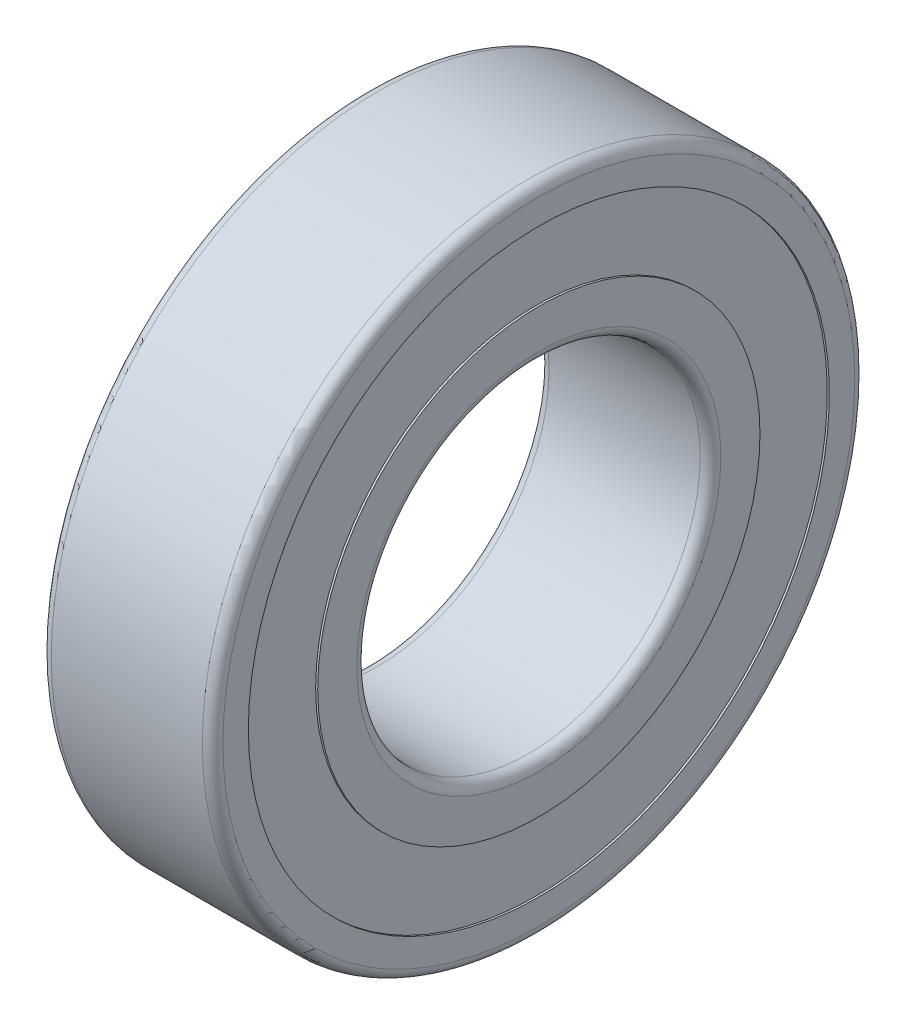
ISO-10303-21;
HEADER;
FILE_DESCRIPTION(('STEP AP214'),'2;1');
FILE_NAME('part.step','',(''),(''),'','','');
FILE_SCHEMA(('AUTOMOTIVE_DESIGN { 1 0 10303 214 1 1 1 1 }'));
ENDSEC;
DATA;
#1=APPLICATION_CONTEXT('core data for automotive mechanical design processes');
#2=APPLICATION_PROTOCOL_DEFINITION('international standard','automotive_design',2000,#1);
#3=PRODUCT_CONTEXT('',#1,'mechanical');
#4=PRODUCT('Part','Part','',(#3));
#5=PRODUCT_RELATED_PRODUCT_CATEGORY('part','',(#4));
#6=PRODUCT_DEFINITION_FORMATION('','',#4);
#7=PRODUCT_DEFINITION_CONTEXT('part definition',#1,'design');
#8=PRODUCT_DEFINITION('design','',#6,#7);
#9=PRODUCT_DEFINITION_SHAPE('','',#8);
#10=(LENGTH_UNIT() NAMED_UNIT(*) SI_UNIT(.MILLI.,.METRE.));
#11=(NAMED_UNIT(*) PLANE_ANGLE_UNIT() SI_UNIT($,.RADIAN.));
#12=(NAMED_UNIT(*) SI_UNIT($,.STERADIAN.) SOLID_ANGLE_UNIT());
#13=UNCERTAINTY_MEASURE_WITH_UNIT(LENGTH_MEASURE(1.E-05),#10,'distance_accuracy_value','');
#14=(GEOMETRIC_REPRESENTATION_CONTEXT(3) GLOBAL_UNCERTAINTY_ASSIGNED_CONTEXT((#13)) GLOBAL_UNIT_ASSIGNED_CONTEXT((#10,
#11,#12)) REPRESENTATION_CONTEXT('',''));
#15=CARTESIAN_POINT('',(0.,0.,0.));
#16=DIRECTION('',(0.,0.,1.));
#17=DIRECTION('',(1.,0.,0.));
#18=AXIS2_PLACEMENT_3D('',#15,#16,#17);
#19=CARTESIAN_POINT('',(2.5,7.25,0.));
#20=DIRECTION('',(0.,-1.,0.));
#21=DIRECTION('',(0.,0.,1.));
#22=AXIS2_PLACEMENT_3D('',#19,#20,#21);
#23=SPHERICAL_SURFACE('',#22,1.3275);
#24=CARTESIAN_POINT('',(2.5,8.5775,0.));
#25=VERTEX_POINT('',#24);
#26=VERTEX_LOOP('',#25);
#27=FACE_BOUND('',#26,.T.);
#28=CARTESIAN_POINT('',(2.5,5.9225,0.));
#29=VERTEX_POINT('',#28);
#30=VERTEX_LOOP('',#29);
#31=FACE_BOUND('',#30,.T.);
#32=ADVANCED_FACE('P0_F16',(#27,#31),#23,.T.);
#33=CLOSED_SHELL('',(#32));
#34=MANIFOLD_SOLID_BREP('P0_B1',#33);
#35=CARTESIAN_POINT('',(2.5,5.86537320921837,-4.26144307912043));
#36=DIRECTION('',(0.,-1.,0.));
#37=DIRECTION('',(0.,0.,1.));
#38=AXIS2_PLACEMENT_3D('',#35,#36,#37);
#39=SPHERICAL_SURFACE('',#38,1.3275);
#40=CARTESIAN_POINT('',(2.5,7.19287320921837,-4.26144307912043));
#41=VERTEX_POINT('',#40);
#42=VERTEX_LOOP('',#41);
#43=FACE_BOUND('',#42,.T.);
#44=CARTESIAN_POINT('',(2.5,4.53787320921837,-4.26144307912043));
#45=VERTEX_POINT('',#44);
#46=VERTEX_LOOP('',#45);
#47=FACE_BOUND('',#46,.T.);
#48=ADVANCED_FACE('P1_F16',(#43,#47),#39,.T.);
#49=CLOSED_SHELL('',(#48));
#50=MANIFOLD_SOLID_BREP('P1_B1',#49);
#51=CARTESIAN_POINT('',(2.5,5.86537320921837,4.26144307912043));
#52=DIRECTION('',(0.,-1.,0.));
#53=DIRECTION('',(0.,0.,1.));
#54=AXIS2_PLACEMENT_3D('',#51,#52,#53);
#55=SPHERICAL_SURFACE('',#54,1.3275);
#56=CARTESIAN_POINT('',(2.5,7.19287320921837,4.26144307912043));
#57=VERTEX_POINT('',#56);
#58=VERTEX_LOOP('',#57);
#59=FACE_BOUND('',#58,.T.);
#60=CARTESIAN_POINT('',(2.5,4.53787320921837,4.26144307912043));
#61=VERTEX_POINT('',#60);
#62=VERTEX_LOOP('',#61);
#63=FACE_BOUND('',#62,.T.);
#64=ADVANCED_FACE('P2_F16',(#59,#63),#55,.T.);
#65=CLOSED_SHELL('',(#64));
#66=MANIFOLD_SOLID_BREP('P2_B1',#65);
#67=CARTESIAN_POINT('',(2.5,2.24037320921837,6.89515974313986));
#68=DIRECTION('',(0.,-1.,0.));
#69=DIRECTION('',(0.,0.,1.));
#70=AXIS2_PLACEMENT_3D('',#67,#68,#69);
#71=SPHERICAL_SURFACE('',#70,1.3275);
#72=CARTESIAN_POINT('',(2.5,3.56787320921837,6.89515974313986));
#73=VERTEX_POINT('',#72);
#74=VERTEX_LOOP('',#73);
#75=FACE_BOUND('',#74,.T.);
#76=CARTESIAN_POINT('',(2.5,0.91287320921837,6.89515974313986));
#77=VERTEX_POINT('',#76);
#78=VERTEX_LOOP('',#77);
#79=FACE_BOUND('',#78,.T.);
#80=ADVANCED_FACE('P3_F16',(#75,#79),#71,.T.);
#81=CLOSED_SHELL('',(#80));
#82=MANIFOLD_SOLID_BREP('P3_B1',#81);
#83=CARTESIAN_POINT('',(2.5,-2.24037320921837,6.89515974313986));
#84=DIRECTION('',(0.,-1.,0.));
#85=DIRECTION('',(0.,0.,1.));
#86=AXIS2_PLACEMENT_3D('',#83,#84,#85);
#87=SPHERICAL_SURFACE('',#86,1.3275);
#88=CARTESIAN_POINT('',(2.5,-0.91287320921837,6.89515974313986));
#89=VERTEX_POINT('',#88);
#90=VERTEX_LOOP('',#89);
#91=FACE_BOUND('',#90,.T.);
#92=CARTESIAN_POINT('',(2.5,-3.56787320921837,6.89515974313986));
#93=VERTEX_POINT('',#92);
#94=VERTEX_LOOP('',#93);
#95=FACE_BOUND('',#94,.T.);
#96=ADVANCED_FACE('P4_F16',(#91,#95),#87,.T.);
#97=CLOSED_SHELL('',(#96));
#98=MANIFOLD_SOLID_BREP('P4_B1',#97);
#99=CARTESIAN_POINT('',(2.5,-5.86537320921837,4.26144307912043));
#100=DIRECTION('',(0.,-1.,0.));
#101=DIRECTION('',(0.,0.,1.));
#102=AXIS2_PLACEMENT_3D('',#99,#100,#101);
#103=SPHERICAL_SURFACE('',#102,1.3275);
#104=CARTESIAN_POINT('',(2.5,-4.53787320921837,4.26144307912043));
#105=VERTEX_POINT('',#104);
#106=VERTEX_LOOP('',#105);
#107=FACE_BOUND('',#106,.T.);
#108=CARTESIAN_POINT('',(2.5,-7.19287320921837,4.26144307912043));
#109=VERTEX_POINT('',#108);
#110=VERTEX_LOOP('',#109);
#111=FACE_BOUND('',#110,.T.);
#112=ADVANCED_FACE('P5_F16',(#107,#111),#103,.T.);
#113=CLOSED_SHELL('',(#112));
#114=MANIFOLD_SOLID_BREP('P5_B1',#113);
#115=CARTESIAN_POINT('',(2.5,-7.25,0.));
#116=DIRECTION('',(0.,-1.,0.));
#117=DIRECTION('',(0.,0.,1.));
#118=AXIS2_PLACEMENT_3D('',#115,#116,#117);
#119=SPHERICAL_SURFACE('',#118,1.3275);
#120=CARTESIAN_POINT('',(2.5,-5.9225,0.));
#121=VERTEX_POINT('',#120);
#122=VERTEX_LOOP('',#121);
#123=FACE_BOUND('',#122,.T.);
#124=CARTESIAN_POINT('',(2.5,-8.5775,0.));
#125=VERTEX_POINT('',#124);
#126=VERTEX_LOOP('',#125);
#127=FACE_BOUND('',#126,.T.);
#128=ADVANCED_FACE('P6_F16',(#123,#127),#119,.T.);
#129=CLOSED_SHELL('',(#128));
#130=MANIFOLD_SOLID_BREP('P6_B1',#129);
#131=CARTESIAN_POINT('',(2.5,-5.86537320921837,-4.26144307912043));
#132=DIRECTION('',(0.,-1.,0.));
#133=DIRECTION('',(0.,0.,1.));
#134=AXIS2_PLACEMENT_3D('',#131,#132,#133);
#135=SPHERICAL_SURFACE('',#134,1.3275);
#136=CARTESIAN_POINT('',(2.5,-4.53787320921837,-4.26144307912043));
#137=VERTEX_POINT('',#136);
#138=VERTEX_LOOP('',#137);
#139=FACE_BOUND('',#138,.T.);
#140=CARTESIAN_POINT('',(2.5,-7.19287320921837,-4.26144307912043));
#141=VERTEX_POINT('',#140);
#142=VERTEX_LOOP('',#141);
#143=FACE_BOUND('',#142,.T.);
#144=ADVANCED_FACE('P7_F16',(#139,#143),#135,.T.);
#145=CLOSED_SHELL('',(#144));
#146=MANIFOLD_SOLID_BREP('P7_B1',#145);
#147=CARTESIAN_POINT('',(2.5,-2.24037320921837,-6.89515974313986));
#148=DIRECTION('',(0.,-1.,0.));
#149=DIRECTION('',(0.,0.,1.));
#150=AXIS2_PLACEMENT_3D('',#147,#148,#149);
#151=SPHERICAL_SURFACE('',#150,1.3275);
#152=CARTESIAN_POINT('',(2.5,-0.91287320921837,-6.89515974313986));
#153=VERTEX_POINT('',#152);
#154=VERTEX_LOOP('',#153);
#155=FACE_BOUND('',#154,.T.);
#156=CARTESIAN_POINT('',(2.5,-3.56787320921837,-6.89515974313986));
#157=VERTEX_POINT('',#156);
#158=VERTEX_LOOP('',#157);
#159=FACE_BOUND('',#158,.T.);
#160=ADVANCED_FACE('P8_F16',(#155,#159),#151,.T.);
#161=CLOSED_SHELL('',(#160));
#162=MANIFOLD_SOLID_BREP('P8_B1',#161);
#163=CARTESIAN_POINT('',(2.5,2.24037320921837,-6.89515974313986));
#164=DIRECTION('',(0.,-1.,0.));
#165=DIRECTION('',(0.,0.,1.));
#166=AXIS2_PLACEMENT_3D('',#163,#164,#165);
#167=SPHERICAL_SURFACE('',#166,1.3275);
#168=CARTESIAN_POINT('',(2.5,3.56787320921837,-6.89515974313986));
#169=VERTEX_POINT('',#168);
#170=VERTEX_LOOP('',#169);
#171=FACE_BOUND('',#170,.T.);
#172=CARTESIAN_POINT('',(2.5,0.91287320921837,-6.89515974313986));
#173=VERTEX_POINT('',#172);
#174=VERTEX_LOOP('',#173);
#175=FACE_BOUND('',#174,.T.);
#176=ADVANCED_FACE('P9_F16',(#171,#175),#167,.T.);
#177=CLOSED_SHELL('',(#176));
#178=MANIFOLD_SOLID_BREP('P9_B1',#177);
#179=CARTESIAN_POINT('',(2.5,0.,0.));
#180=DIRECTION('',(1.,0.,0.));
#181=DIRECTION('',(0.,0.,-1.));
#182=AXIS2_PLACEMENT_3D('',#179,#180,#181);
#183=TOROIDAL_SURFACE('',#182,7.25,1.35);
#184=CARTESIAN_POINT('',(1.42,0.,0.));
#185=DIRECTION('',(-1.,0.,0.));
#186=DIRECTION('',(0.,0.,1.));
#187=AXIS2_PLACEMENT_3D('',#184,#185,#186);
#188=CIRCLE('',#187,6.44);
#189=CARTESIAN_POINT('',(1.42,0.,6.44));
#190=VERTEX_POINT('',#189);
#191=EDGE_CURVE('P10_E110',#190,#190,#188,.T.);
#192=ORIENTED_EDGE('',*,*,#191,.F.);
#193=EDGE_LOOP('',(#192));
#194=FACE_BOUND('',#193,.T.);
#195=CARTESIAN_POINT('',(3.58,0.,0.));
#196=DIRECTION('',(-1.,0.,0.));
#197=DIRECTION('',(0.,0.,1.));
#198=AXIS2_PLACEMENT_3D('',#195,#196,#197);
#199=CIRCLE('',#198,6.44);
#200=CARTESIAN_POINT('',(3.58,0.,6.44));
#201=VERTEX_POINT('',#200);
#202=EDGE_CURVE('P10_E115',#201,#201,#199,.F.);
#203=ORIENTED_EDGE('',*,*,#202,.F.);
#204=EDGE_LOOP('',(#203));
#205=FACE_BOUND('',#204,.T.);
#206=ADVANCED_FACE('P10_F15',(#194,#205),#183,.F.);
#207=CARTESIAN_POINT('',(5.,0.,0.));
#208=DIRECTION('',(-1.,0.,0.));
#209=DIRECTION('',(0.,0.,1.));
#210=AXIS2_PLACEMENT_3D('',#207,#208,#209);
#211=CYLINDRICAL_SURFACE('',#210,6.44);
#212=CARTESIAN_POINT('',(5.,0.,0.));
#213=DIRECTION('',(-1.,0.,0.));
#214=DIRECTION('',(0.,0.,1.));
#215=AXIS2_PLACEMENT_3D('',#212,#213,#214);
#216=CIRCLE('',#215,6.44);
#217=CARTESIAN_POINT('',(5.,0.,6.44));
#218=VERTEX_POINT('',#217);
#219=EDGE_CURVE('P10_E19',#218,#218,#216,.F.);
#220=ORIENTED_EDGE('',*,*,#219,.F.);
#221=EDGE_LOOP('',(#220));
#222=FACE_BOUND('',#221,.T.);
#223=ORIENTED_EDGE('',*,*,#202,.T.);
#224=EDGE_LOOP('',(#223));
#225=FACE_BOUND('',#224,.T.);
#226=ADVANCED_FACE('P10_F85',(#222,#225),#211,.T.);
#227=CARTESIAN_POINT('',(5.,0.,0.));
#228=DIRECTION('',(-1.,0.,0.));
#229=DIRECTION('',(0.,0.,1.));
#230=AXIS2_PLACEMENT_3D('',#227,#228,#229);
#231=CYLINDRICAL_SURFACE('',#230,6.44);
#232=ORIENTED_EDGE('',*,*,#191,.T.);
#233=EDGE_LOOP('',(#232));
#234=FACE_BOUND('',#233,.T.);
#235=CARTESIAN_POINT('',(0.,0.,0.));
#236=DIRECTION('',(-1.,0.,0.));
#237=DIRECTION('',(0.,0.,1.));
#238=AXIS2_PLACEMENT_3D('',#235,#236,#237);
#239=CIRCLE('',#238,6.44);
#240=CARTESIAN_POINT('',(0.,0.,6.44));
#241=VERTEX_POINT('',#240);
#242=EDGE_CURVE('P10_E105',#241,#241,#239,.T.);
#243=ORIENTED_EDGE('',*,*,#242,.F.);
#244=EDGE_LOOP('',(#243));
#245=FACE_BOUND('',#244,.T.);
#246=ADVANCED_FACE('P10_F82',(#234,#245),#231,.T.);
#247=CARTESIAN_POINT('',(5.,5.3,0.));
#248=DIRECTION('',(1.,0.,0.));
#249=DIRECTION('',(0.,0.,-1.));
#250=AXIS2_PLACEMENT_3D('',#247,#248,#249);
#251=PLANE('',#250);
#252=CARTESIAN_POINT('',(5.,0.,0.));
#253=DIRECTION('',(1.,0.,0.));
#254=DIRECTION('',(0.,0.,-1.));
#255=AXIS2_PLACEMENT_3D('',#252,#253,#254);
#256=CIRCLE('',#255,5.3);
#257=CARTESIAN_POINT('',(5.,0.,-5.3));
#258=VERTEX_POINT('',#257);
#259=EDGE_CURVE('P10_E66',#258,#258,#256,.T.);
#260=ORIENTED_EDGE('',*,*,#259,.F.);
#261=EDGE_LOOP('',(#260));
#262=FACE_BOUND('',#261,.T.);
#263=ORIENTED_EDGE('',*,*,#219,.T.);
#264=EDGE_LOOP('',(#263));
#265=FACE_BOUND('',#264,.T.);
#266=ADVANCED_FACE('P10_F72',(#262,#265),#251,.T.);
#267=CARTESIAN_POINT('',(0.,6.44,0.));
#268=DIRECTION('',(-1.,0.,0.));
#269=DIRECTION('',(0.,0.,1.));
#270=AXIS2_PLACEMENT_3D('',#267,#268,#269);
#271=PLANE('',#270);
#272=ORIENTED_EDGE('',*,*,#242,.T.);
#273=EDGE_LOOP('',(#272));
#274=FACE_BOUND('',#273,.T.);
#275=CARTESIAN_POINT('',(0.,0.,0.));
#276=DIRECTION('',(-1.,0.,0.));
#277=DIRECTION('',(0.,0.,-1.));
#278=AXIS2_PLACEMENT_3D('',#275,#276,#277);
#279=CIRCLE('',#278,5.3);
#280=CARTESIAN_POINT('',(0.,0.,-5.3));
#281=VERTEX_POINT('',#280);
#282=EDGE_CURVE('P10_E28',#281,#281,#279,.T.);
#283=ORIENTED_EDGE('',*,*,#282,.F.);
#284=EDGE_LOOP('',(#283));
#285=FACE_BOUND('',#284,.T.);
#286=ADVANCED_FACE('P10_F81',(#274,#285),#271,.T.);
#287=CARTESIAN_POINT('',(4.7,0.,0.));
#288=DIRECTION('',(1.,0.,0.));
#289=DIRECTION('',(0.,0.,-1.));
#290=AXIS2_PLACEMENT_3D('',#287,#288,#289);
#291=TOROIDAL_SURFACE('',#290,5.3,0.300000000000003);
#292=CARTESIAN_POINT('',(4.7,0.,0.));
#293=DIRECTION('',(-1.,0.,0.));
#294=DIRECTION('',(0.,0.,1.));
#295=AXIS2_PLACEMENT_3D('',#292,#293,#294);
#296=CIRCLE('',#295,5.);
#297=CARTESIAN_POINT('',(4.7,0.,5.));
#298=VERTEX_POINT('',#297);
#299=EDGE_CURVE('P10_E23',#298,#298,#296,.T.);
#300=ORIENTED_EDGE('',*,*,#299,.T.);
#301=EDGE_LOOP('',(#300));
#302=FACE_BOUND('',#301,.T.);
#303=ORIENTED_EDGE('',*,*,#259,.T.);
#304=EDGE_LOOP('',(#303));
#305=FACE_BOUND('',#304,.T.);
#306=ADVANCED_FACE('P10_F46',(#302,#305),#291,.T.);
#307=CARTESIAN_POINT('',(0.300000000000002,0.,0.));
#308=DIRECTION('',(1.,0.,0.));
#309=DIRECTION('',(0.,0.,-1.));
#310=AXIS2_PLACEMENT_3D('',#307,#308,#309);
#311=TOROIDAL_SURFACE('',#310,5.3,0.300000000000002);
#312=ORIENTED_EDGE('',*,*,#282,.T.);
#313=EDGE_LOOP('',(#312));
#314=FACE_BOUND('',#313,.T.);
#315=CARTESIAN_POINT('',(0.300000000000002,0.,0.));
#316=DIRECTION('',(-1.,0.,0.));
#317=DIRECTION('',(0.,0.,1.));
#318=AXIS2_PLACEMENT_3D('',#315,#316,#317);
#319=CIRCLE('',#318,5.);
#320=CARTESIAN_POINT('',(0.300000000000002,0.,5.));
#321=VERTEX_POINT('',#320);
#322=EDGE_CURVE('P10_E10',#321,#321,#319,.F.);
#323=ORIENTED_EDGE('',*,*,#322,.T.);
#324=EDGE_LOOP('',(#323));
#325=FACE_BOUND('',#324,.T.);
#326=ADVANCED_FACE('P10_F40',(#314,#325),#311,.T.);
#327=CARTESIAN_POINT('',(5.,0.,0.));
#328=DIRECTION('',(-1.,0.,0.));
#329=DIRECTION('',(0.,0.,1.));
#330=AXIS2_PLACEMENT_3D('',#327,#328,#329);
#331=CYLINDRICAL_SURFACE('',#330,5.);
#332=ORIENTED_EDGE('',*,*,#322,.F.);
#333=EDGE_LOOP('',(#332));
#334=FACE_BOUND('',#333,.T.);
#335=ORIENTED_EDGE('',*,*,#299,.F.);
#336=EDGE_LOOP('',(#335));
#337=FACE_BOUND('',#336,.T.);
#338=ADVANCED_FACE('P10_F45',(#334,#337),#331,.F.);
#339=CLOSED_SHELL('',(#206,#226,#246,#266,#286,#306,#326,#338));
#340=MANIFOLD_SOLID_BREP('P10_B1',#339);
#341=CARTESIAN_POINT('',(2.5,0.,0.));
#342=DIRECTION('',(1.,0.,0.));
#343=DIRECTION('',(0.,0.,-1.));
#344=AXIS2_PLACEMENT_3D('',#341,#342,#343);
#345=TOROIDAL_SURFACE('',#344,7.25,1.35);
#346=CARTESIAN_POINT('',(3.58,0.,0.));
#347=DIRECTION('',(-1.,0.,0.));
#348=DIRECTION('',(0.,0.,1.));
#349=AXIS2_PLACEMENT_3D('',#346,#347,#348);
#350=CIRCLE('',#349,8.06);
#351=CARTESIAN_POINT('',(3.58,0.,8.06));
#352=VERTEX_POINT('',#351);
#353=EDGE_CURVE('P11_E140',#352,#352,#350,.F.);
#354=ORIENTED_EDGE('',*,*,#353,.T.);
#355=EDGE_LOOP('',(#354));
#356=FACE_BOUND('',#355,.T.);
#357=CARTESIAN_POINT('',(1.42,0.,0.));
#358=DIRECTION('',(-1.,0.,0.));
#359=DIRECTION('',(0.,0.,1.));
#360=AXIS2_PLACEMENT_3D('',#357,#358,#359);
#361=CIRCLE('',#360,8.06);
#362=CARTESIAN_POINT('',(1.42,0.,8.06));
#363=VERTEX_POINT('',#362);
#364=EDGE_CURVE('P11_E143',#363,#363,#361,.T.);
#365=ORIENTED_EDGE('',*,*,#364,.T.);
#366=EDGE_LOOP('',(#365));
#367=FACE_BOUND('',#366,.T.);
#368=ADVANCED_FACE('P11_F15',(#356,#367),#345,.F.);
#369=CARTESIAN_POINT('',(5.,0.,0.));
#370=DIRECTION('',(-1.,0.,0.));
#371=DIRECTION('',(0.,0.,1.));
#372=AXIS2_PLACEMENT_3D('',#369,#370,#371);
#373=CYLINDRICAL_SURFACE('',#372,8.06);
#374=CARTESIAN_POINT('',(0.23,0.,0.));
#375=DIRECTION('',(-1.,0.,0.));
#376=DIRECTION('',(0.,0.,1.));
#377=AXIS2_PLACEMENT_3D('',#374,#375,#376);
#378=CIRCLE('',#377,8.06);
#379=CARTESIAN_POINT('',(0.23,0.,8.06));
#380=VERTEX_POINT('',#379);
#381=EDGE_CURVE('P11_E19',#380,#380,#378,.T.);
#382=ORIENTED_EDGE('',*,*,#381,.T.);
#383=EDGE_LOOP('',(#382));
#384=FACE_BOUND('',#383,.T.);
#385=ORIENTED_EDGE('',*,*,#364,.F.);
#386=EDGE_LOOP('',(#385));
#387=FACE_BOUND('',#386,.T.);
#388=ADVANCED_FACE('P11_F101',(#384,#387),#373,.F.);
#389=CARTESIAN_POINT('',(5.,0.,0.));
#390=DIRECTION('',(-1.,0.,0.));
#391=DIRECTION('',(0.,0.,1.));
#392=AXIS2_PLACEMENT_3D('',#389,#390,#391);
#393=CYLINDRICAL_SURFACE('',#392,8.06);
#394=ORIENTED_EDGE('',*,*,#353,.F.);
#395=EDGE_LOOP('',(#394));
#396=FACE_BOUND('',#395,.T.);
#397=CARTESIAN_POINT('',(4.77,0.,0.));
#398=DIRECTION('',(-1.,0.,0.));
#399=DIRECTION('',(0.,0.,1.));
#400=AXIS2_PLACEMENT_3D('',#397,#398,#399);
#401=CIRCLE('',#400,8.06);
#402=CARTESIAN_POINT('',(4.77,0.,8.06));
#403=VERTEX_POINT('',#402);
#404=EDGE_CURVE('P11_E136',#403,#403,#401,.F.);
#405=ORIENTED_EDGE('',*,*,#404,.T.);
#406=EDGE_LOOP('',(#405));
#407=FACE_BOUND('',#406,.T.);
#408=ADVANCED_FACE('P11_F98',(#396,#407),#393,.F.);
#409=CARTESIAN_POINT('',(0.23,7.925,0.));
#410=DIRECTION('',(1.,0.,0.));
#411=DIRECTION('',(0.,0.,-1.));
#412=AXIS2_PLACEMENT_3D('',#409,#410,#411);
#413=PLANE('',#412);
#414=ORIENTED_EDGE('',*,*,#381,.F.);
#415=EDGE_LOOP('',(#414));
#416=FACE_BOUND('',#415,.T.);
#417=CARTESIAN_POINT('',(0.23,0.,0.));
#418=DIRECTION('',(-1.,0.,0.));
#419=DIRECTION('',(0.,0.,1.));
#420=AXIS2_PLACEMENT_3D('',#417,#418,#419);
#421=CIRCLE('',#420,8.460005);
#422=CARTESIAN_POINT('',(0.23,0.,8.460005));
#423=VERTEX_POINT('',#422);
#424=EDGE_CURVE('P11_E134',#423,#423,#421,.T.);
#425=ORIENTED_EDGE('',*,*,#424,.T.);
#426=EDGE_LOOP('',(#425));
#427=FACE_BOUND('',#426,.T.);
#428=ADVANCED_FACE('P11_F94',(#416,#427),#413,.F.);
#429=CARTESIAN_POINT('',(4.77,8.460005,0.));
#430=DIRECTION('',(-1.,0.,0.));
#431=DIRECTION('',(0.,0.,1.));
#432=AXIS2_PLACEMENT_3D('',#429,#430,#431);
#433=PLANE('',#432);
#434=CARTESIAN_POINT('',(4.77,0.,0.));
#435=DIRECTION('',(-1.,0.,0.));
#436=DIRECTION('',(0.,0.,1.));
#437=AXIS2_PLACEMENT_3D('',#434,#435,#436);
#438=CIRCLE('',#437,8.460005);
#439=CARTESIAN_POINT('',(4.77,0.,8.460005));
#440=VERTEX_POINT('',#439);
#441=EDGE_CURVE('P11_E127',#440,#440,#438,.F.);
#442=ORIENTED_EDGE('',*,*,#441,.T.);
#443=EDGE_LOOP('',(#442));
#444=FACE_BOUND('',#443,.T.);
#445=ORIENTED_EDGE('',*,*,#404,.F.);
#446=EDGE_LOOP('',(#445));
#447=FACE_BOUND('',#446,.T.);
#448=ADVANCED_FACE('P11_F90',(#444,#447),#433,.F.);
#449=CARTESIAN_POINT('',(5.,0.,0.));
#450=DIRECTION('',(-1.,0.,0.));
#451=DIRECTION('',(0.,0.,1.));
#452=AXIS2_PLACEMENT_3D('',#449,#450,#451);
#453=CYLINDRICAL_SURFACE('',#452,8.460005);
#454=ORIENTED_EDGE('',*,*,#424,.F.);
#455=EDGE_LOOP('',(#454));
#456=FACE_BOUND('',#455,.T.);
#457=CARTESIAN_POINT('',(0.,0.,0.));
#458=DIRECTION('',(-1.,0.,0.));
#459=DIRECTION('',(0.,0.,1.));
#460=AXIS2_PLACEMENT_3D('',#457,#458,#459);
#461=CIRCLE('',#460,8.460005);
#462=CARTESIAN_POINT('',(0.,0.,8.460005));
#463=VERTEX_POINT('',#462);
#464=EDGE_CURVE('P11_E122',#463,#463,#461,.F.);
#465=ORIENTED_EDGE('',*,*,#464,.F.);
#466=EDGE_LOOP('',(#465));
#467=FACE_BOUND('',#466,.T.);
#468=ADVANCED_FACE('P11_F86',(#456,#467),#453,.F.);
#469=CARTESIAN_POINT('',(5.,0.,0.));
#470=DIRECTION('',(-1.,0.,0.));
#471=DIRECTION('',(0.,0.,1.));
#472=AXIS2_PLACEMENT_3D('',#469,#470,#471);
#473=CYLINDRICAL_SURFACE('',#472,8.460005);
#474=CARTESIAN_POINT('',(5.,0.,0.));
#475=DIRECTION('',(-1.,0.,0.));
#476=DIRECTION('',(0.,0.,1.));
#477=AXIS2_PLACEMENT_3D('',#474,#475,#476);
#478=CIRCLE('',#477,8.460005);
#479=CARTESIAN_POINT('',(5.,0.,8.460005));
#480=VERTEX_POINT('',#479);
#481=EDGE_CURVE('P11_E120',#480,#480,#478,.T.);
#482=ORIENTED_EDGE('',*,*,#481,.F.);
#483=EDGE_LOOP('',(#482));
#484=FACE_BOUND('',#483,.T.);
#485=ORIENTED_EDGE('',*,*,#441,.F.);
#486=EDGE_LOOP('',(#485));
#487=FACE_BOUND('',#486,.T.);
#488=ADVANCED_FACE('P11_F82',(#484,#487),#473,.F.);
#489=CARTESIAN_POINT('',(0.,9.2,0.));
#490=DIRECTION('',(-1.,0.,0.));
#491=DIRECTION('',(0.,0.,1.));
#492=AXIS2_PLACEMENT_3D('',#489,#490,#491);
#493=PLANE('',#492);
#494=CARTESIAN_POINT('',(0.,0.,0.));
#495=DIRECTION('',(1.,0.,0.));
#496=DIRECTION('',(0.,0.,-1.));
#497=AXIS2_PLACEMENT_3D('',#494,#495,#496);
#498=CIRCLE('',#497,9.2);
#499=CARTESIAN_POINT('',(0.,0.,-9.2));
#500=VERTEX_POINT('',#499);
#501=EDGE_CURVE('P11_E66',#500,#500,#498,.T.);
#502=ORIENTED_EDGE('',*,*,#501,.F.);
#503=EDGE_LOOP('',(#502));
#504=FACE_BOUND('',#503,.T.);
#505=ORIENTED_EDGE('',*,*,#464,.T.);
#506=EDGE_LOOP('',(#505));
#507=FACE_BOUND('',#506,.T.);
#508=ADVANCED_FACE('P11_F72',(#504,#507),#493,.T.);
#509=CARTESIAN_POINT('',(5.,8.06,0.));
#510=DIRECTION('',(1.,0.,0.));
#511=DIRECTION('',(0.,0.,-1.));
#512=AXIS2_PLACEMENT_3D('',#509,#510,#511);
#513=PLANE('',#512);
#514=ORIENTED_EDGE('',*,*,#481,.T.);
#515=EDGE_LOOP('',(#514));
#516=FACE_BOUND('',#515,.T.);
#517=CARTESIAN_POINT('',(5.,0.,0.));
#518=DIRECTION('',(-1.,0.,0.));
#519=DIRECTION('',(0.,0.,-1.));
#520=AXIS2_PLACEMENT_3D('',#517,#518,#519);
#521=CIRCLE('',#520,9.2);
#522=CARTESIAN_POINT('',(5.,0.,-9.2));
#523=VERTEX_POINT('',#522);
#524=EDGE_CURVE('P11_E28',#523,#523,#521,.T.);
#525=ORIENTED_EDGE('',*,*,#524,.F.);
#526=EDGE_LOOP('',(#525));
#527=FACE_BOUND('',#526,.T.);
#528=ADVANCED_FACE('P11_F81',(#516,#527),#513,.T.);
#529=CARTESIAN_POINT('',(0.300000000000002,0.,0.));
#530=DIRECTION('',(1.,0.,0.));
#531=DIRECTION('',(0.,0.,-1.));
#532=AXIS2_PLACEMENT_3D('',#529,#530,#531);
#533=TOROIDAL_SURFACE('',#532,9.2,0.300000000000002);
#534=CARTESIAN_POINT('',(0.300000000000001,0.,0.));
#535=DIRECTION('',(-1.,0.,0.));
#536=DIRECTION('',(0.,0.,1.));
#537=AXIS2_PLACEMENT_3D('',#534,#535,#536);
#538=CIRCLE('',#537,9.5);
#539=CARTESIAN_POINT('',(0.300000000000001,0.,9.5));
#540=VERTEX_POINT('',#539);
#541=EDGE_CURVE('P11_E23',#540,#540,#538,.F.);
#542=ORIENTED_EDGE('',*,*,#541,.F.);
#543=EDGE_LOOP('',(#542));
#544=FACE_BOUND('',#543,.T.);
#545=ORIENTED_EDGE('',*,*,#501,.T.);
#546=EDGE_LOOP('',(#545));
#547=FACE_BOUND('',#546,.T.);
#548=ADVANCED_FACE('P11_F46',(#544,#547),#533,.T.);
#549=CARTESIAN_POINT('',(4.7,0.,0.));
#550=DIRECTION('',(1.,0.,0.));
#551=DIRECTION('',(0.,0.,-1.));
#552=AXIS2_PLACEMENT_3D('',#549,#550,#551);
#553=TOROIDAL_SURFACE('',#552,9.2,0.300000000000003);
#554=ORIENTED_EDGE('',*,*,#524,.T.);
#555=EDGE_LOOP('',(#554));
#556=FACE_BOUND('',#555,.T.);
#557=CARTESIAN_POINT('',(4.7,0.,0.));
#558=DIRECTION('',(-1.,0.,0.));
#559=DIRECTION('',(0.,0.,1.));
#560=AXIS2_PLACEMENT_3D('',#557,#558,#559);
#561=CIRCLE('',#560,9.5);
#562=CARTESIAN_POINT('',(4.7,0.,9.5));
#563=VERTEX_POINT('',#562);
#564=EDGE_CURVE('P11_E10',#563,#563,#561,.T.);
#565=ORIENTED_EDGE('',*,*,#564,.F.);
#566=EDGE_LOOP('',(#565));
#567=FACE_BOUND('',#566,.T.);
#568=ADVANCED_FACE('P11_F40',(#556,#567),#553,.T.);
#569=CARTESIAN_POINT('',(5.,0.,0.));
#570=DIRECTION('',(-1.,0.,0.));
#571=DIRECTION('',(0.,0.,1.));
#572=AXIS2_PLACEMENT_3D('',#569,#570,#571);
#573=CYLINDRICAL_SURFACE('',#572,9.5);
#574=ORIENTED_EDGE('',*,*,#564,.T.);
#575=EDGE_LOOP('',(#574));
#576=FACE_BOUND('',#575,.T.);
#577=ORIENTED_EDGE('',*,*,#541,.T.);
#578=EDGE_LOOP('',(#577));
#579=FACE_BOUND('',#578,.T.);
#580=ADVANCED_FACE('P11_F45',(#576,#579),#573,.T.);
#581=CLOSED_SHELL('',(#368,#388,#408,#428,#448,#468,#488,#508,#528,#548,#568,#580));
#582=MANIFOLD_SOLID_BREP('P11_B1',#581);
#583=CARTESIAN_POINT('',(0.06,8.460005,0.));
#584=DIRECTION('',(-1.,0.,0.));
#585=DIRECTION('',(0.,0.,1.));
#586=AXIS2_PLACEMENT_3D('',#583,#584,#585);
#587=PLANE('',#586);
#588=CARTESIAN_POINT('',(0.06,0.,0.));
#589=DIRECTION('',(-1.,0.,0.));
#590=DIRECTION('',(0.,0.,1.));
#591=AXIS2_PLACEMENT_3D('',#588,#589,#590);
#592=CIRCLE('',#591,8.460005);
#593=CARTESIAN_POINT('',(0.06,0.,8.460005));
#594=VERTEX_POINT('',#593);
#595=EDGE_CURVE('P12_E18',#594,#594,#592,.F.);
#596=ORIENTED_EDGE('',*,*,#595,.F.);
#597=EDGE_LOOP('',(#596));
#598=FACE_BOUND('',#597,.T.);
#599=CARTESIAN_POINT('',(0.06,0.,0.));
#600=DIRECTION('',(-1.,0.,0.));
#601=DIRECTION('',(0.,0.,1.));
#602=AXIS2_PLACEMENT_3D('',#599,#600,#601);
#603=CIRCLE('',#602,6.44);
#604=CARTESIAN_POINT('',(0.06,0.,6.44));
#605=VERTEX_POINT('',#604);
#606=EDGE_CURVE('P12_E27',#605,#605,#603,.F.);
#607=ORIENTED_EDGE('',*,*,#606,.T.);
#608=EDGE_LOOP('',(#607));
#609=FACE_BOUND('',#608,.T.);
#610=ADVANCED_FACE('P12_F15',(#598,#609),#587,.T.);
#611=CARTESIAN_POINT('',(0.23,0.,0.));
#612=DIRECTION('',(-1.,0.,0.));
#613=DIRECTION('',(0.,0.,1.));
#614=AXIS2_PLACEMENT_3D('',#611,#612,#613);
#615=CYLINDRICAL_SURFACE('',#614,8.460005);
#616=CARTESIAN_POINT('',(0.23,0.,0.));
#617=DIRECTION('',(-1.,0.,0.));
#618=DIRECTION('',(0.,0.,1.));
#619=AXIS2_PLACEMENT_3D('',#616,#617,#618);
#620=CIRCLE('',#619,8.460005);
#621=CARTESIAN_POINT('',(0.23,0.,8.460005));
#622=VERTEX_POINT('',#621);
#623=EDGE_CURVE('P12_E22',#622,#622,#620,.F.);
#624=ORIENTED_EDGE('',*,*,#623,.F.);
#625=EDGE_LOOP('',(#624));
#626=FACE_BOUND('',#625,.T.);
#627=ORIENTED_EDGE('',*,*,#595,.T.);
#628=EDGE_LOOP('',(#627));
#629=FACE_BOUND('',#628,.T.);
#630=ADVANCED_FACE('P12_F35',(#626,#629),#615,.T.);
#631=CARTESIAN_POINT('',(0.23,0.,0.));
#632=DIRECTION('',(-1.,0.,0.));
#633=DIRECTION('',(0.,0.,1.));
#634=AXIS2_PLACEMENT_3D('',#631,#632,#633);
#635=CYLINDRICAL_SURFACE('',#634,6.44);
#636=ORIENTED_EDGE('',*,*,#606,.F.);
#637=EDGE_LOOP('',(#636));
#638=FACE_BOUND('',#637,.T.);
#639=CARTESIAN_POINT('',(0.23,0.,0.));
#640=DIRECTION('',(-1.,0.,0.));
#641=DIRECTION('',(0.,0.,1.));
#642=AXIS2_PLACEMENT_3D('',#639,#640,#641);
#643=CIRCLE('',#642,6.44);
#644=CARTESIAN_POINT('',(0.23,0.,6.44));
#645=VERTEX_POINT('',#644);
#646=EDGE_CURVE('P12_E10',#645,#645,#643,.T.);
#647=ORIENTED_EDGE('',*,*,#646,.F.);
#648=EDGE_LOOP('',(#647));
#649=FACE_BOUND('',#648,.T.);
#650=ADVANCED_FACE('P12_F42',(#638,#649),#635,.F.);
#651=CARTESIAN_POINT('',(0.23,6.44,0.));
#652=DIRECTION('',(1.,0.,0.));
#653=DIRECTION('',(0.,0.,-1.));
#654=AXIS2_PLACEMENT_3D('',#651,#652,#653);
#655=PLANE('',#654);
#656=ORIENTED_EDGE('',*,*,#646,.T.);
#657=EDGE_LOOP('',(#656));
#658=FACE_BOUND('',#657,.T.);
#659=ORIENTED_EDGE('',*,*,#623,.T.);
#660=EDGE_LOOP('',(#659));
#661=FACE_BOUND('',#660,.T.);
#662=ADVANCED_FACE('P12_F44',(#658,#661),#655,.T.);
#663=CLOSED_SHELL('',(#610,#630,#650,#662));
#664=MANIFOLD_SOLID_BREP('P12_B1',#663);
#665=CARTESIAN_POINT('',(4.94,-8.460005,0.));
#666=DIRECTION('',(1.,0.,0.));
#667=DIRECTION('',(0.,0.,1.));
#668=AXIS2_PLACEMENT_3D('',#665,#666,#667);
#669=PLANE('',#668);
#670=CARTESIAN_POINT('',(4.94,0.,0.));
#671=DIRECTION('',(1.,0.,0.));
#672=DIRECTION('',(0.,0.,1.));
#673=AXIS2_PLACEMENT_3D('',#670,#671,#672);
#674=CIRCLE('',#673,8.460005);
#675=CARTESIAN_POINT('',(4.94,0.,8.460005));
#676=VERTEX_POINT('',#675);
#677=EDGE_CURVE('P13_E18',#676,#676,#674,.F.);
#678=ORIENTED_EDGE('',*,*,#677,.F.);
#679=EDGE_LOOP('',(#678));
#680=FACE_BOUND('',#679,.T.);
#681=CARTESIAN_POINT('',(4.94,0.,0.));
#682=DIRECTION('',(1.,0.,0.));
#683=DIRECTION('',(0.,0.,1.));
#684=AXIS2_PLACEMENT_3D('',#681,#682,#683);
#685=CIRCLE('',#684,6.44);
#686=CARTESIAN_POINT('',(4.94,0.,6.44));
#687=VERTEX_POINT('',#686);
#688=EDGE_CURVE('P13_E27',#687,#687,#685,.F.);
#689=ORIENTED_EDGE('',*,*,#688,.T.);
#690=EDGE_LOOP('',(#689));
#691=FACE_BOUND('',#690,.T.);
#692=ADVANCED_FACE('P13_F15',(#680,#691),#669,.T.);
#693=CARTESIAN_POINT('',(4.77,0.,0.));
#694=DIRECTION('',(1.,0.,0.));
#695=DIRECTION('',(0.,0.,1.));
#696=AXIS2_PLACEMENT_3D('',#693,#694,#695);
#697=CYLINDRICAL_SURFACE('',#696,8.460005);
#698=CARTESIAN_POINT('',(4.77,0.,0.));
#699=DIRECTION('',(1.,0.,0.));
#700=DIRECTION('',(0.,0.,1.));
#701=AXIS2_PLACEMENT_3D('',#698,#699,#700);
#702=CIRCLE('',#701,8.460005);
#703=CARTESIAN_POINT('',(4.77,0.,8.460005));
#704=VERTEX_POINT('',#703);
#705=EDGE_CURVE('P13_E22',#704,#704,#702,.F.);
#706=ORIENTED_EDGE('',*,*,#705,.F.);
#707=EDGE_LOOP('',(#706));
#708=FACE_BOUND('',#707,.T.);
#709=ORIENTED_EDGE('',*,*,#677,.T.);
#710=EDGE_LOOP('',(#709));
#711=FACE_BOUND('',#710,.T.);
#712=ADVANCED_FACE('P13_F35',(#708,#711),#697,.T.);
#713=CARTESIAN_POINT('',(4.77,0.,0.));
#714=DIRECTION('',(1.,0.,0.));
#715=DIRECTION('',(0.,0.,1.));
#716=AXIS2_PLACEMENT_3D('',#713,#714,#715);
#717=CYLINDRICAL_SURFACE('',#716,6.44);
#718=ORIENTED_EDGE('',*,*,#688,.F.);
#719=EDGE_LOOP('',(#718));
#720=FACE_BOUND('',#719,.T.);
#721=CARTESIAN_POINT('',(4.77,0.,0.));
#722=DIRECTION('',(1.,0.,0.));
#723=DIRECTION('',(0.,0.,1.));
#724=AXIS2_PLACEMENT_3D('',#721,#722,#723);
#725=CIRCLE('',#724,6.44);
#726=CARTESIAN_POINT('',(4.77,0.,6.44));
#727=VERTEX_POINT('',#726);
#728=EDGE_CURVE('P13_E10',#727,#727,#725,.T.);
#729=ORIENTED_EDGE('',*,*,#728,.F.);
#730=EDGE_LOOP('',(#729));
#731=FACE_BOUND('',#730,.T.);
#732=ADVANCED_FACE('P13_F42',(#720,#731),#717,.F.);
#733=CARTESIAN_POINT('',(4.77,-6.44,0.));
#734=DIRECTION('',(-1.,0.,0.));
#735=DIRECTION('',(0.,0.,-1.));
#736=AXIS2_PLACEMENT_3D('',#733,#734,#735);
#737=PLANE('',#736);
#738=ORIENTED_EDGE('',*,*,#728,.T.);
#739=EDGE_LOOP('',(#738));
#740=FACE_BOUND('',#739,.T.);
#741=ORIENTED_EDGE('',*,*,#705,.T.);
#742=EDGE_LOOP('',(#741));
#743=FACE_BOUND('',#742,.T.);
#744=ADVANCED_FACE('P13_F44',(#740,#743),#737,.T.);
#745=CLOSED_SHELL('',(#692,#712,#732,#744));
#746=MANIFOLD_SOLID_BREP('P13_B1',#745);
#747=ADVANCED_BREP_SHAPE_REPRESENTATION('',(#18,#34,#50,#66,#82,#98,#114,#130,#146,#162,#178,
#340,#582,#664,#746),#14);
#748=SHAPE_DEFINITION_REPRESENTATION(#9,#747);
ENDSEC;
END-ISO-10303-21;
